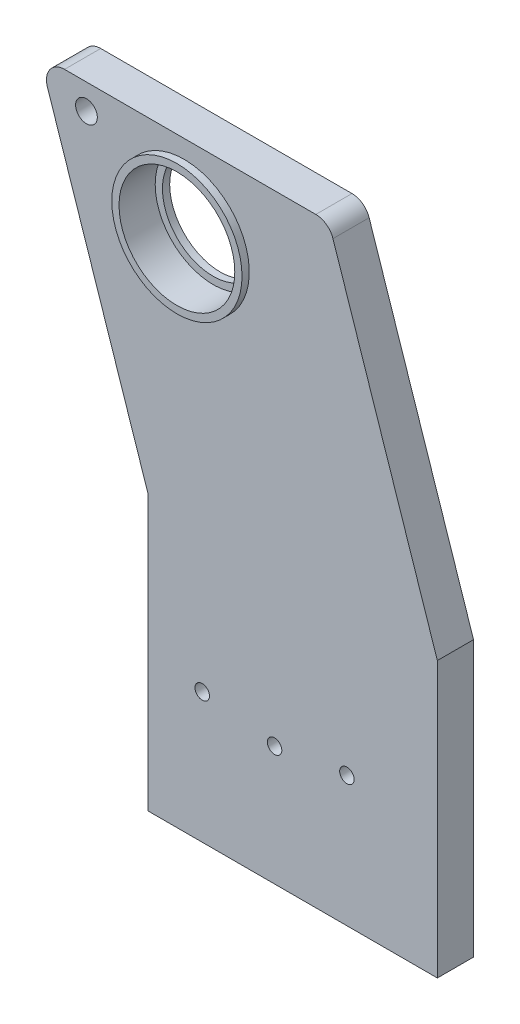
ISO-10303-21;
HEADER;
FILE_DESCRIPTION(('STEP AP214'),'2;1');
FILE_NAME('part.step','',(''),(''),'','','');
FILE_SCHEMA(('AUTOMOTIVE_DESIGN { 1 0 10303 214 1 1 1 1 }'));
ENDSEC;
DATA;
#1=APPLICATION_CONTEXT('core data for automotive mechanical design processes');
#2=APPLICATION_PROTOCOL_DEFINITION('international standard','automotive_design',2000,#1);
#3=PRODUCT_CONTEXT('',#1,'mechanical');
#4=PRODUCT('Part','Part','',(#3));
#5=PRODUCT_RELATED_PRODUCT_CATEGORY('part','',(#4));
#6=PRODUCT_DEFINITION_FORMATION('','',#4);
#7=PRODUCT_DEFINITION_CONTEXT('part definition',#1,'design');
#8=PRODUCT_DEFINITION('design','',#6,#7);
#9=PRODUCT_DEFINITION_SHAPE('','',#8);
#10=(LENGTH_UNIT() NAMED_UNIT(*) SI_UNIT(.MILLI.,.METRE.));
#11=(NAMED_UNIT(*) PLANE_ANGLE_UNIT() SI_UNIT($,.RADIAN.));
#12=(NAMED_UNIT(*) SI_UNIT($,.STERADIAN.) SOLID_ANGLE_UNIT());
#13=UNCERTAINTY_MEASURE_WITH_UNIT(LENGTH_MEASURE(1.E-05),#10,'distance_accuracy_value','');
#14=(GEOMETRIC_REPRESENTATION_CONTEXT(3) GLOBAL_UNCERTAINTY_ASSIGNED_CONTEXT((#13)) GLOBAL_UNIT_ASSIGNED_CONTEXT((#10,
#11,#12)) REPRESENTATION_CONTEXT('',''));
#15=CARTESIAN_POINT('',(0.,0.,0.));
#16=DIRECTION('',(0.,0.,1.));
#17=DIRECTION('',(1.,0.,0.));
#18=AXIS2_PLACEMENT_3D('',#15,#16,#17);
#19=CARTESIAN_POINT('',(-30.,60.,10.));
#20=DIRECTION('',(0.,0.,-1.));
#21=DIRECTION('',(-1.,0.,0.));
#22=AXIS2_PLACEMENT_3D('',#19,#20,#21);
#23=CYLINDRICAL_SURFACE('',#22,16.);
#24=CARTESIAN_POINT('',(-30.,60.,12.));
#25=DIRECTION('',(0.,0.,1.));
#26=DIRECTION('',(1.,0.,0.));
#27=AXIS2_PLACEMENT_3D('',#24,#25,#26);
#28=CIRCLE('',#27,16.);
#29=CARTESIAN_POINT('',(-14.,60.,12.));
#30=VERTEX_POINT('',#29);
#31=EDGE_CURVE('E188',#30,#30,#28,.T.);
#32=ORIENTED_EDGE('',*,*,#31,.T.);
#33=EDGE_LOOP('',(#32));
#34=FACE_BOUND('',#33,.T.);
#35=CARTESIAN_POINT('',(-30.,60.,2.));
#36=DIRECTION('',(0.,0.,-1.));
#37=DIRECTION('',(-1.,0.,0.));
#38=AXIS2_PLACEMENT_3D('',#35,#36,#37);
#39=CIRCLE('',#38,16.);
#40=CARTESIAN_POINT('',(-46.,60.,2.));
#41=VERTEX_POINT('',#40);
#42=EDGE_CURVE('E215',#41,#41,#39,.T.);
#43=ORIENTED_EDGE('',*,*,#42,.T.);
#44=EDGE_LOOP('',(#43));
#45=FACE_BOUND('',#44,.T.);
#46=ADVANCED_FACE('F36',(#34,#45),#23,.F.);
#47=CARTESIAN_POINT('',(0.,0.,10.));
#48=DIRECTION('',(0.,0.,-1.));
#49=DIRECTION('',(-1.,0.,0.));
#50=AXIS2_PLACEMENT_3D('',#47,#48,#49);
#51=PLANE('',#50);
#52=CARTESIAN_POINT('',(-57.,76.,10.));
#53=DIRECTION('',(0.,0.,-1.));
#54=DIRECTION('',(-1.,0.,0.));
#55=AXIS2_PLACEMENT_3D('',#52,#53,#54);
#56=CIRCLE('',#55,3.);
#57=CARTESIAN_POINT('',(-60.,76.,10.));
#58=VERTEX_POINT('',#57);
#59=EDGE_CURVE('E207',#58,#58,#56,.F.);
#60=ORIENTED_EDGE('',*,*,#59,.F.);
#61=EDGE_LOOP('',(#60));
#62=FACE_BOUND('',#61,.T.);
#63=CARTESIAN_POINT('',(-4.99999999999998,-50.,10.));
#64=DIRECTION('',(0.,0.,-1.));
#65=DIRECTION('',(-1.,0.,0.));
#66=AXIS2_PLACEMENT_3D('',#63,#64,#65);
#67=CIRCLE('',#66,2.);
#68=CARTESIAN_POINT('',(-6.99999999999998,-50.,10.));
#69=VERTEX_POINT('',#68);
#70=EDGE_CURVE('E196',#69,#69,#67,.T.);
#71=ORIENTED_EDGE('',*,*,#70,.T.);
#72=EDGE_LOOP('',(#71));
#73=FACE_BOUND('',#72,.T.);
#74=CARTESIAN_POINT('',(15.,-47.,10.));
#75=DIRECTION('',(0.,0.,-1.));
#76=DIRECTION('',(-1.,0.,0.));
#77=AXIS2_PLACEMENT_3D('',#74,#75,#76);
#78=CIRCLE('',#77,2.);
#79=CARTESIAN_POINT('',(13.,-47.,10.));
#80=VERTEX_POINT('',#79);
#81=EDGE_CURVE('E191',#80,#80,#78,.T.);
#82=ORIENTED_EDGE('',*,*,#81,.T.);
#83=EDGE_LOOP('',(#82));
#84=FACE_BOUND('',#83,.T.);
#85=CARTESIAN_POINT('',(-25.,-47.,10.));
#86=DIRECTION('',(0.,0.,-1.));
#87=DIRECTION('',(-1.,0.,0.));
#88=AXIS2_PLACEMENT_3D('',#85,#86,#87);
#89=CIRCLE('',#88,2.);
#90=CARTESIAN_POINT('',(-27.,-47.,10.));
#91=VERTEX_POINT('',#90);
#92=EDGE_CURVE('E195',#91,#91,#89,.T.);
#93=ORIENTED_EDGE('',*,*,#92,.T.);
#94=EDGE_LOOP('',(#93));
#95=FACE_BOUND('',#94,.T.);
#96=DIRECTION('',(-0.316227766016838,0.948683298050514,0.));
#97=VECTOR('',#96,1.);
#98=CARTESIAN_POINT('',(9.99999999999999,83.,10.));
#99=LINE('',#98,#97);
#100=CARTESIAN_POINT('',(40.,-7.00000000000001,10.));
#101=VERTEX_POINT('',#100);
#102=CARTESIAN_POINT('',(11.1396203899719,79.5811388300842,10.));
#103=VERTEX_POINT('',#102);
#104=EDGE_CURVE('E149',#101,#103,#99,.T.);
#105=ORIENTED_EDGE('',*,*,#104,.T.);
#106=CARTESIAN_POINT('',(6.39620389971936,78.,10.));
#107=DIRECTION('',(0.,0.,-1.));
#108=DIRECTION('',(-1.,0.,0.));
#109=AXIS2_PLACEMENT_3D('',#106,#107,#108);
#110=CIRCLE('',#109,5.);
#111=CARTESIAN_POINT('',(6.39620389971936,83.,10.));
#112=VERTEX_POINT('',#111);
#113=EDGE_CURVE('E44',#103,#112,#110,.F.);
#114=ORIENTED_EDGE('',*,*,#113,.T.);
#115=DIRECTION('',(-1.,0.,0.));
#116=VECTOR('',#115,1.);
#117=CARTESIAN_POINT('',(9.99999999999999,83.,10.));
#118=LINE('',#117,#116);
#119=CARTESIAN_POINT('',(-63.062870566386,83.,10.));
#120=VERTEX_POINT('',#119);
#121=EDGE_CURVE('E148',#112,#120,#118,.T.);
#122=ORIENTED_EDGE('',*,*,#121,.T.);
#123=CARTESIAN_POINT('',(-63.062870566386,78.,10.));
#124=DIRECTION('',(0.,0.,-1.));
#125=DIRECTION('',(-1.,0.,0.));
#126=AXIS2_PLACEMENT_3D('',#123,#124,#125);
#127=CIRCLE('',#126,5.);
#128=CARTESIAN_POINT('',(-67.8062870566386,76.4188611699158,10.));
#129=VERTEX_POINT('',#128);
#130=EDGE_CURVE('E51',#120,#129,#127,.F.);
#131=ORIENTED_EDGE('',*,*,#130,.T.);
#132=DIRECTION('',(0.316227766016838,-0.948683298050514,0.));
#133=VECTOR('',#132,1.);
#134=CARTESIAN_POINT('',(-70.,83.,10.));
#135=LINE('',#134,#133);
#136=CARTESIAN_POINT('',(-40.,-7.00000000000002,10.));
#137=VERTEX_POINT('',#136);
#138=EDGE_CURVE('E119',#129,#137,#135,.T.);
#139=ORIENTED_EDGE('',*,*,#138,.T.);
#140=DIRECTION('',(0.,-1.,0.));
#141=VECTOR('',#140,1.);
#142=CARTESIAN_POINT('',(-40.,-7.00000000000002,10.));
#143=LINE('',#142,#141);
#144=CARTESIAN_POINT('',(-40.,-83.,10.));
#145=VERTEX_POINT('',#144);
#146=EDGE_CURVE('E114',#137,#145,#143,.T.);
#147=ORIENTED_EDGE('',*,*,#146,.T.);
#148=DIRECTION('',(1.,0.,0.));
#149=VECTOR('',#148,1.);
#150=CARTESIAN_POINT('',(40.,-83.,10.));
#151=LINE('',#150,#149);
#152=CARTESIAN_POINT('',(40.,-83.,10.));
#153=VERTEX_POINT('',#152);
#154=EDGE_CURVE('E104',#145,#153,#151,.T.);
#155=ORIENTED_EDGE('',*,*,#154,.T.);
#156=DIRECTION('',(0.,1.,0.));
#157=VECTOR('',#156,1.);
#158=CARTESIAN_POINT('',(40.,-7.00000000000001,10.));
#159=LINE('',#158,#157);
#160=EDGE_CURVE('E113',#153,#101,#159,.T.);
#161=ORIENTED_EDGE('',*,*,#160,.T.);
#162=EDGE_LOOP('',(#105,#114,#122,#131,#139,#147,#155,#161));
#163=FACE_BOUND('',#162,.T.);
#164=CARTESIAN_POINT('',(-30.,60.,10.));
#165=DIRECTION('',(0.,0.,-1.));
#166=DIRECTION('',(-1.,0.,0.));
#167=AXIS2_PLACEMENT_3D('',#164,#165,#166);
#168=CIRCLE('',#167,18.);
#169=CARTESIAN_POINT('',(-48.,60.,10.));
#170=VERTEX_POINT('',#169);
#171=EDGE_CURVE('E128',#170,#170,#168,.F.);
#172=ORIENTED_EDGE('',*,*,#171,.F.);
#173=EDGE_LOOP('',(#172));
#174=FACE_BOUND('',#173,.T.);
#175=ADVANCED_FACE('F117',(#62,#73,#84,#95,#163,#174),#51,.F.);
#176=CARTESIAN_POINT('',(0.,0.,0.));
#177=DIRECTION('',(0.,0.,-1.));
#178=DIRECTION('',(-1.,0.,0.));
#179=AXIS2_PLACEMENT_3D('',#176,#177,#178);
#180=PLANE('',#179);
#181=CARTESIAN_POINT('',(-57.,76.,0.));
#182=DIRECTION('',(0.,0.,-1.));
#183=DIRECTION('',(-1.,0.,0.));
#184=AXIS2_PLACEMENT_3D('',#181,#182,#183);
#185=CIRCLE('',#184,3.);
#186=CARTESIAN_POINT('',(-60.,76.,0.));
#187=VERTEX_POINT('',#186);
#188=EDGE_CURVE('E212',#187,#187,#185,.T.);
#189=ORIENTED_EDGE('',*,*,#188,.F.);
#190=EDGE_LOOP('',(#189));
#191=FACE_BOUND('',#190,.T.);
#192=CARTESIAN_POINT('',(-4.99999999999998,-50.,0.));
#193=DIRECTION('',(0.,0.,-1.));
#194=DIRECTION('',(-1.,0.,0.));
#195=AXIS2_PLACEMENT_3D('',#192,#193,#194);
#196=CIRCLE('',#195,2.);
#197=CARTESIAN_POINT('',(-6.99999999999998,-50.,0.));
#198=VERTEX_POINT('',#197);
#199=EDGE_CURVE('E204',#198,#198,#196,.T.);
#200=ORIENTED_EDGE('',*,*,#199,.F.);
#201=EDGE_LOOP('',(#200));
#202=FACE_BOUND('',#201,.T.);
#203=CARTESIAN_POINT('',(15.,-47.,0.));
#204=DIRECTION('',(0.,0.,-1.));
#205=DIRECTION('',(-1.,0.,0.));
#206=AXIS2_PLACEMENT_3D('',#203,#204,#205);
#207=CIRCLE('',#206,2.);
#208=CARTESIAN_POINT('',(13.,-47.,0.));
#209=VERTEX_POINT('',#208);
#210=EDGE_CURVE('E199',#209,#209,#207,.T.);
#211=ORIENTED_EDGE('',*,*,#210,.F.);
#212=EDGE_LOOP('',(#211));
#213=FACE_BOUND('',#212,.T.);
#214=CARTESIAN_POINT('',(-25.,-47.,0.));
#215=DIRECTION('',(0.,0.,-1.));
#216=DIRECTION('',(-1.,0.,0.));
#217=AXIS2_PLACEMENT_3D('',#214,#215,#216);
#218=CIRCLE('',#217,2.);
#219=CARTESIAN_POINT('',(-27.,-47.,0.));
#220=VERTEX_POINT('',#219);
#221=EDGE_CURVE('E192',#220,#220,#218,.T.);
#222=ORIENTED_EDGE('',*,*,#221,.F.);
#223=EDGE_LOOP('',(#222));
#224=FACE_BOUND('',#223,.T.);
#225=DIRECTION('',(-1.,0.,0.));
#226=VECTOR('',#225,1.);
#227=CARTESIAN_POINT('',(-40.,83.,0.));
#228=LINE('',#227,#226);
#229=CARTESIAN_POINT('',(6.39620389971936,83.,0.));
#230=VERTEX_POINT('',#229);
#231=CARTESIAN_POINT('',(-63.062870566386,83.,0.));
#232=VERTEX_POINT('',#231);
#233=EDGE_CURVE('E165',#230,#232,#228,.T.);
#234=ORIENTED_EDGE('',*,*,#233,.F.);
#235=CARTESIAN_POINT('',(6.39620389971936,78.,0.));
#236=DIRECTION('',(0.,0.,-1.));
#237=DIRECTION('',(-1.,0.,0.));
#238=AXIS2_PLACEMENT_3D('',#235,#236,#237);
#239=CIRCLE('',#238,5.);
#240=CARTESIAN_POINT('',(11.1396203899719,79.5811388300842,0.));
#241=VERTEX_POINT('',#240);
#242=EDGE_CURVE('E143',#230,#241,#239,.T.);
#243=ORIENTED_EDGE('',*,*,#242,.T.);
#244=DIRECTION('',(-0.316227766016838,0.948683298050514,0.));
#245=VECTOR('',#244,1.);
#246=CARTESIAN_POINT('',(9.99999999999999,83.,0.));
#247=LINE('',#246,#245);
#248=CARTESIAN_POINT('',(40.,-7.00000000000001,0.));
#249=VERTEX_POINT('',#248);
#250=EDGE_CURVE('E164',#249,#241,#247,.T.);
#251=ORIENTED_EDGE('',*,*,#250,.F.);
#252=DIRECTION('',(0.,1.,0.));
#253=VECTOR('',#252,1.);
#254=CARTESIAN_POINT('',(40.,-7.00000000000001,0.));
#255=LINE('',#254,#253);
#256=CARTESIAN_POINT('',(40.,-83.,0.));
#257=VERTEX_POINT('',#256);
#258=EDGE_CURVE('E169',#257,#249,#255,.T.);
#259=ORIENTED_EDGE('',*,*,#258,.F.);
#260=DIRECTION('',(1.,0.,0.));
#261=VECTOR('',#260,1.);
#262=CARTESIAN_POINT('',(40.,-83.,0.));
#263=LINE('',#262,#261);
#264=CARTESIAN_POINT('',(-40.,-83.,0.));
#265=VERTEX_POINT('',#264);
#266=EDGE_CURVE('E172',#265,#257,#263,.T.);
#267=ORIENTED_EDGE('',*,*,#266,.F.);
#268=DIRECTION('',(0.,-1.,0.));
#269=VECTOR('',#268,1.);
#270=CARTESIAN_POINT('',(-40.,-7.00000000000002,0.));
#271=LINE('',#270,#269);
#272=CARTESIAN_POINT('',(-40.,-7.00000000000002,0.));
#273=VERTEX_POINT('',#272);
#274=EDGE_CURVE('E127',#273,#265,#271,.T.);
#275=ORIENTED_EDGE('',*,*,#274,.F.);
#276=DIRECTION('',(0.316227766016838,-0.948683298050514,0.));
#277=VECTOR('',#276,1.);
#278=CARTESIAN_POINT('',(-70.,83.,0.));
#279=LINE('',#278,#277);
#280=CARTESIAN_POINT('',(-67.8062870566386,76.4188611699158,0.));
#281=VERTEX_POINT('',#280);
#282=EDGE_CURVE('E123',#281,#273,#279,.T.);
#283=ORIENTED_EDGE('',*,*,#282,.F.);
#284=CARTESIAN_POINT('',(-63.062870566386,78.,0.));
#285=DIRECTION('',(0.,0.,-1.));
#286=DIRECTION('',(-1.,0.,0.));
#287=AXIS2_PLACEMENT_3D('',#284,#285,#286);
#288=CIRCLE('',#287,5.);
#289=EDGE_CURVE('E141',#281,#232,#288,.T.);
#290=ORIENTED_EDGE('',*,*,#289,.T.);
#291=EDGE_LOOP('',(#234,#243,#251,#259,#267,#275,#283,#290));
#292=FACE_BOUND('',#291,.T.);
#293=CARTESIAN_POINT('',(-30.,60.,0.));
#294=DIRECTION('',(0.,0.,-1.));
#295=DIRECTION('',(-1.,0.,0.));
#296=AXIS2_PLACEMENT_3D('',#293,#294,#295);
#297=CIRCLE('',#296,14.);
#298=CARTESIAN_POINT('',(-44.,60.,0.));
#299=VERTEX_POINT('',#298);
#300=EDGE_CURVE('E218',#299,#299,#297,.T.);
#301=ORIENTED_EDGE('',*,*,#300,.F.);
#302=EDGE_LOOP('',(#301));
#303=FACE_BOUND('',#302,.T.);
#304=ADVANCED_FACE('F161',(#191,#202,#213,#224,#292,#303),#180,.T.);
#305=CARTESIAN_POINT('',(-40.,-7.00000000000002,10.));
#306=DIRECTION('',(1.,0.,0.));
#307=DIRECTION('',(0.,1.,0.));
#308=AXIS2_PLACEMENT_3D('',#305,#306,#307);
#309=PLANE('',#308);
#310=ORIENTED_EDGE('',*,*,#274,.T.);
#311=DIRECTION('',(0.,0.,-1.));
#312=VECTOR('',#311,1.);
#313=CARTESIAN_POINT('',(-40.,-83.,10.));
#314=LINE('',#313,#312);
#315=EDGE_CURVE('E108',#145,#265,#314,.T.);
#316=ORIENTED_EDGE('',*,*,#315,.F.);
#317=ORIENTED_EDGE('',*,*,#146,.F.);
#318=DIRECTION('',(0.,0.,-1.));
#319=VECTOR('',#318,1.);
#320=CARTESIAN_POINT('',(-40.,-7.00000000000002,10.));
#321=LINE('',#320,#319);
#322=EDGE_CURVE('E177',#137,#273,#321,.T.);
#323=ORIENTED_EDGE('',*,*,#322,.T.);
#324=EDGE_LOOP('',(#310,#316,#317,#323));
#325=FACE_BOUND('',#324,.T.);
#326=ADVANCED_FACE('F125',(#325),#309,.F.);
#327=CARTESIAN_POINT('',(40.,-83.,10.));
#328=DIRECTION('',(0.,1.,0.));
#329=DIRECTION('',(0.,0.,1.));
#330=AXIS2_PLACEMENT_3D('',#327,#328,#329);
#331=PLANE('',#330);
#332=ORIENTED_EDGE('',*,*,#266,.T.);
#333=DIRECTION('',(0.,0.,-1.));
#334=VECTOR('',#333,1.);
#335=CARTESIAN_POINT('',(40.,-83.,10.));
#336=LINE('',#335,#334);
#337=EDGE_CURVE('E111',#153,#257,#336,.T.);
#338=ORIENTED_EDGE('',*,*,#337,.F.);
#339=ORIENTED_EDGE('',*,*,#154,.F.);
#340=ORIENTED_EDGE('',*,*,#315,.T.);
#341=EDGE_LOOP('',(#332,#338,#339,#340));
#342=FACE_BOUND('',#341,.T.);
#343=ADVANCED_FACE('F106',(#342),#331,.F.);
#344=CARTESIAN_POINT('',(40.,-7.00000000000001,10.));
#345=DIRECTION('',(-1.,0.,0.));
#346=DIRECTION('',(0.,0.,1.));
#347=AXIS2_PLACEMENT_3D('',#344,#345,#346);
#348=PLANE('',#347);
#349=ORIENTED_EDGE('',*,*,#258,.T.);
#350=DIRECTION('',(0.,0.,-1.));
#351=VECTOR('',#350,1.);
#352=CARTESIAN_POINT('',(40.,-7.00000000000001,10.));
#353=LINE('',#352,#351);
#354=EDGE_CURVE('E133',#101,#249,#353,.T.);
#355=ORIENTED_EDGE('',*,*,#354,.F.);
#356=ORIENTED_EDGE('',*,*,#160,.F.);
#357=ORIENTED_EDGE('',*,*,#337,.T.);
#358=EDGE_LOOP('',(#349,#355,#356,#357));
#359=FACE_BOUND('',#358,.T.);
#360=ADVANCED_FACE('F183',(#359),#348,.F.);
#361=CARTESIAN_POINT('',(9.99999999999999,83.,10.));
#362=DIRECTION('',(-0.948683298050514,-0.316227766016838,0.));
#363=DIRECTION('',(0.316227766016838,-0.948683298050514,0.));
#364=AXIS2_PLACEMENT_3D('',#361,#362,#363);
#365=PLANE('',#364);
#366=ORIENTED_EDGE('',*,*,#250,.T.);
#367=DIRECTION('',(0.,0.,-1.));
#368=VECTOR('',#367,1.);
#369=CARTESIAN_POINT('',(11.1396203899719,79.5811388300842,10.));
#370=LINE('',#369,#368);
#371=EDGE_CURVE('E59',#241,#103,#370,.F.);
#372=ORIENTED_EDGE('',*,*,#371,.T.);
#373=ORIENTED_EDGE('',*,*,#104,.F.);
#374=ORIENTED_EDGE('',*,*,#354,.T.);
#375=EDGE_LOOP('',(#366,#372,#373,#374));
#376=FACE_BOUND('',#375,.T.);
#377=ADVANCED_FACE('F167',(#376),#365,.F.);
#378=CARTESIAN_POINT('',(-40.,83.,10.));
#379=DIRECTION('',(0.,-1.,0.));
#380=DIRECTION('',(0.,0.,-1.));
#381=AXIS2_PLACEMENT_3D('',#378,#379,#380);
#382=PLANE('',#381);
#383=ORIENTED_EDGE('',*,*,#121,.F.);
#384=DIRECTION('',(0.,0.,-1.));
#385=VECTOR('',#384,1.);
#386=CARTESIAN_POINT('',(6.39620389971936,83.,10.));
#387=LINE('',#386,#385);
#388=EDGE_CURVE('E138',#112,#230,#387,.T.);
#389=ORIENTED_EDGE('',*,*,#388,.T.);
#390=ORIENTED_EDGE('',*,*,#233,.T.);
#391=DIRECTION('',(0.,0.,-1.));
#392=VECTOR('',#391,1.);
#393=CARTESIAN_POINT('',(-63.062870566386,83.,10.));
#394=LINE('',#393,#392);
#395=EDGE_CURVE('E131',#232,#120,#394,.F.);
#396=ORIENTED_EDGE('',*,*,#395,.T.);
#397=EDGE_LOOP('',(#383,#389,#390,#396));
#398=FACE_BOUND('',#397,.T.);
#399=ADVANCED_FACE('F153',(#398),#382,.F.);
#400=CARTESIAN_POINT('',(-70.,83.,10.));
#401=DIRECTION('',(0.948683298050514,0.316227766016838,0.));
#402=DIRECTION('',(-0.316227766016838,0.948683298050514,0.));
#403=AXIS2_PLACEMENT_3D('',#400,#401,#402);
#404=PLANE('',#403);
#405=ORIENTED_EDGE('',*,*,#138,.F.);
#406=DIRECTION('',(0.,0.,-1.));
#407=VECTOR('',#406,1.);
#408=CARTESIAN_POINT('',(-67.8062870566386,76.4188611699158,10.));
#409=LINE('',#408,#407);
#410=EDGE_CURVE('E11',#129,#281,#409,.T.);
#411=ORIENTED_EDGE('',*,*,#410,.T.);
#412=ORIENTED_EDGE('',*,*,#282,.T.);
#413=ORIENTED_EDGE('',*,*,#322,.F.);
#414=EDGE_LOOP('',(#405,#411,#412,#413));
#415=FACE_BOUND('',#414,.T.);
#416=ADVANCED_FACE('F255',(#415),#404,.F.);
#417=CARTESIAN_POINT('',(-30.,60.,12.));
#418=DIRECTION('',(0.,0.,1.));
#419=DIRECTION('',(1.,0.,0.));
#420=AXIS2_PLACEMENT_3D('',#417,#418,#419);
#421=PLANE('',#420);
#422=CARTESIAN_POINT('',(-30.,60.,12.));
#423=DIRECTION('',(0.,0.,1.));
#424=DIRECTION('',(1.,0.,0.));
#425=AXIS2_PLACEMENT_3D('',#422,#423,#424);
#426=CIRCLE('',#425,18.);
#427=CARTESIAN_POINT('',(-12.,60.,12.));
#428=VERTEX_POINT('',#427);
#429=EDGE_CURVE('E181',#428,#428,#426,.T.);
#430=ORIENTED_EDGE('',*,*,#429,.T.);
#431=EDGE_LOOP('',(#430));
#432=FACE_BOUND('',#431,.T.);
#433=ORIENTED_EDGE('',*,*,#31,.F.);
#434=EDGE_LOOP('',(#433));
#435=FACE_BOUND('',#434,.T.);
#436=ADVANCED_FACE('F251',(#432,#435),#421,.T.);
#437=CARTESIAN_POINT('',(-30.,60.,12.));
#438=DIRECTION('',(0.,0.,-1.));
#439=DIRECTION('',(-1.,0.,0.));
#440=AXIS2_PLACEMENT_3D('',#437,#438,#439);
#441=CYLINDRICAL_SURFACE('',#440,18.);
#442=ORIENTED_EDGE('',*,*,#429,.F.);
#443=EDGE_LOOP('',(#442));
#444=FACE_BOUND('',#443,.T.);
#445=ORIENTED_EDGE('',*,*,#171,.T.);
#446=EDGE_LOOP('',(#445));
#447=FACE_BOUND('',#446,.T.);
#448=ADVANCED_FACE('F247',(#444,#447),#441,.T.);
#449=CARTESIAN_POINT('',(-25.,-47.,10.));
#450=DIRECTION('',(0.,0.,-1.));
#451=DIRECTION('',(-1.,0.,0.));
#452=AXIS2_PLACEMENT_3D('',#449,#450,#451);
#453=CYLINDRICAL_SURFACE('',#452,2.);
#454=ORIENTED_EDGE('',*,*,#92,.F.);
#455=EDGE_LOOP('',(#454));
#456=FACE_BOUND('',#455,.T.);
#457=ORIENTED_EDGE('',*,*,#221,.T.);
#458=EDGE_LOOP('',(#457));
#459=FACE_BOUND('',#458,.T.);
#460=ADVANCED_FACE('F250',(#456,#459),#453,.F.);
#461=CARTESIAN_POINT('',(15.,-47.,10.));
#462=DIRECTION('',(0.,0.,-1.));
#463=DIRECTION('',(-1.,0.,0.));
#464=AXIS2_PLACEMENT_3D('',#461,#462,#463);
#465=CYLINDRICAL_SURFACE('',#464,2.);
#466=ORIENTED_EDGE('',*,*,#81,.F.);
#467=EDGE_LOOP('',(#466));
#468=FACE_BOUND('',#467,.T.);
#469=ORIENTED_EDGE('',*,*,#210,.T.);
#470=EDGE_LOOP('',(#469));
#471=FACE_BOUND('',#470,.T.);
#472=ADVANCED_FACE('F259',(#468,#471),#465,.F.);
#473=CARTESIAN_POINT('',(-4.99999999999998,-50.,10.));
#474=DIRECTION('',(0.,0.,-1.));
#475=DIRECTION('',(-1.,0.,0.));
#476=AXIS2_PLACEMENT_3D('',#473,#474,#475);
#477=CYLINDRICAL_SURFACE('',#476,2.);
#478=ORIENTED_EDGE('',*,*,#70,.F.);
#479=EDGE_LOOP('',(#478));
#480=FACE_BOUND('',#479,.T.);
#481=ORIENTED_EDGE('',*,*,#199,.T.);
#482=EDGE_LOOP('',(#481));
#483=FACE_BOUND('',#482,.T.);
#484=ADVANCED_FACE('F263',(#480,#483),#477,.F.);
#485=CARTESIAN_POINT('',(-57.,76.,12.001));
#486=DIRECTION('',(0.,0.,-1.));
#487=DIRECTION('',(-1.,0.,0.));
#488=AXIS2_PLACEMENT_3D('',#485,#486,#487);
#489=CYLINDRICAL_SURFACE('',#488,3.);
#490=ORIENTED_EDGE('',*,*,#188,.T.);
#491=EDGE_LOOP('',(#490));
#492=FACE_BOUND('',#491,.T.);
#493=ORIENTED_EDGE('',*,*,#59,.T.);
#494=EDGE_LOOP('',(#493));
#495=FACE_BOUND('',#494,.T.);
#496=ADVANCED_FACE('F267',(#492,#495),#489,.F.);
#497=CARTESIAN_POINT('',(6.39620389971936,78.,10.));
#498=DIRECTION('',(0.,0.,-1.));
#499=DIRECTION('',(-1.,0.,0.));
#500=AXIS2_PLACEMENT_3D('',#497,#498,#499);
#501=CYLINDRICAL_SURFACE('',#500,5.);
#502=ORIENTED_EDGE('',*,*,#113,.F.);
#503=ORIENTED_EDGE('',*,*,#371,.F.);
#504=ORIENTED_EDGE('',*,*,#242,.F.);
#505=ORIENTED_EDGE('',*,*,#388,.F.);
#506=EDGE_LOOP('',(#502,#503,#504,#505));
#507=FACE_BOUND('',#506,.T.);
#508=ADVANCED_FACE('F158',(#507),#501,.T.);
#509=CARTESIAN_POINT('',(-63.062870566386,78.,10.));
#510=DIRECTION('',(0.,0.,-1.));
#511=DIRECTION('',(-1.,0.,0.));
#512=AXIS2_PLACEMENT_3D('',#509,#510,#511);
#513=CYLINDRICAL_SURFACE('',#512,5.);
#514=ORIENTED_EDGE('',*,*,#130,.F.);
#515=ORIENTED_EDGE('',*,*,#395,.F.);
#516=ORIENTED_EDGE('',*,*,#289,.F.);
#517=ORIENTED_EDGE('',*,*,#410,.F.);
#518=EDGE_LOOP('',(#514,#515,#516,#517));
#519=FACE_BOUND('',#518,.T.);
#520=ADVANCED_FACE('F38',(#519),#513,.T.);
#521=CARTESIAN_POINT('',(-30.,60.,2.));
#522=DIRECTION('',(0.,0.,-1.));
#523=DIRECTION('',(-1.,0.,0.));
#524=AXIS2_PLACEMENT_3D('',#521,#522,#523);
#525=PLANE('',#524);
#526=ORIENTED_EDGE('',*,*,#42,.F.);
#527=EDGE_LOOP('',(#526));
#528=FACE_BOUND('',#527,.T.);
#529=CARTESIAN_POINT('',(-30.,60.,2.));
#530=DIRECTION('',(0.,0.,-1.));
#531=DIRECTION('',(-1.,0.,0.));
#532=AXIS2_PLACEMENT_3D('',#529,#530,#531);
#533=CIRCLE('',#532,14.);
#534=CARTESIAN_POINT('',(-44.,60.,2.));
#535=VERTEX_POINT('',#534);
#536=EDGE_CURVE('E219',#535,#535,#533,.T.);
#537=ORIENTED_EDGE('',*,*,#536,.T.);
#538=EDGE_LOOP('',(#537));
#539=FACE_BOUND('',#538,.T.);
#540=ADVANCED_FACE('F272',(#528,#539),#525,.F.);
#541=CARTESIAN_POINT('',(-30.,60.,0.));
#542=DIRECTION('',(0.,0.,1.));
#543=DIRECTION('',(1.,0.,0.));
#544=AXIS2_PLACEMENT_3D('',#541,#542,#543);
#545=CYLINDRICAL_SURFACE('',#544,14.);
#546=ORIENTED_EDGE('',*,*,#300,.T.);
#547=EDGE_LOOP('',(#546));
#548=FACE_BOUND('',#547,.T.);
#549=ORIENTED_EDGE('',*,*,#536,.F.);
#550=EDGE_LOOP('',(#549));
#551=FACE_BOUND('',#550,.T.);
#552=ADVANCED_FACE('F225',(#548,#551),#545,.F.);
#553=CLOSED_SHELL('',(#46,#175,#304,#326,#343,#360,#377,#399,#416,#436,#448,#460,#472,#484,#496,
#508,#520,#540,#552));
#554=MANIFOLD_SOLID_BREP('B2',#553);
#555=ADVANCED_BREP_SHAPE_REPRESENTATION('',(#18,#554),#14);
#556=SHAPE_DEFINITION_REPRESENTATION(#9,#555);
ENDSEC;
END-ISO-10303-21;
